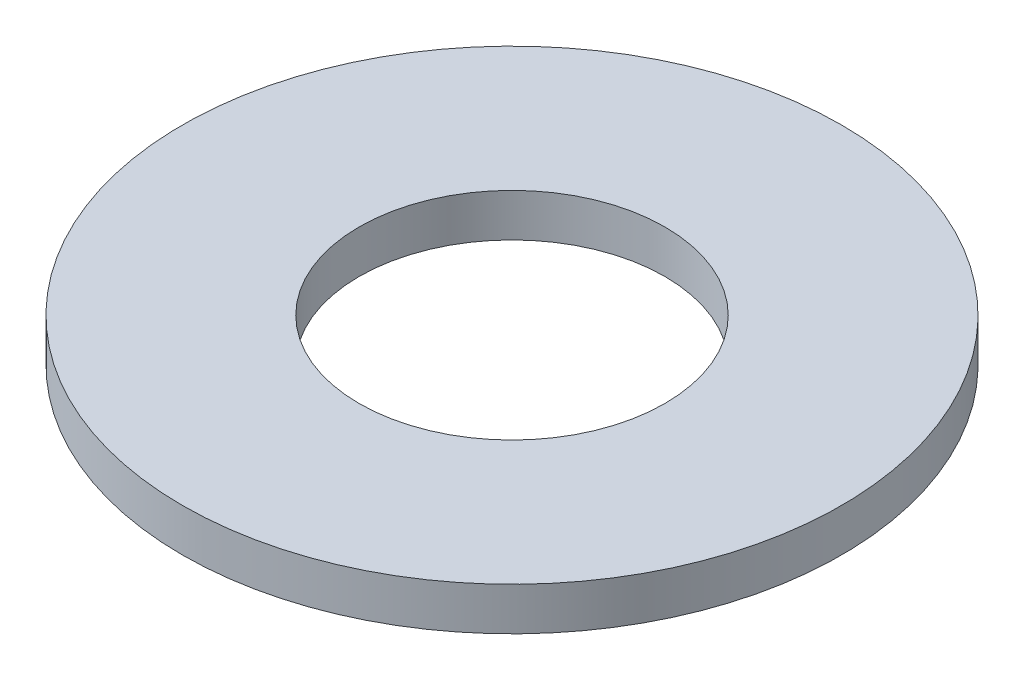
ISO-10303-21;
HEADER;
FILE_DESCRIPTION(('STEP AP214'),'2;1');
FILE_NAME('part.step','',(''),(''),'','','');
FILE_SCHEMA(('AUTOMOTIVE_DESIGN { 1 0 10303 214 1 1 1 1 }'));
ENDSEC;
DATA;
#1=APPLICATION_CONTEXT('core data for automotive mechanical design processes');
#2=APPLICATION_PROTOCOL_DEFINITION('international standard','automotive_design',2000,#1);
#3=PRODUCT_CONTEXT('',#1,'mechanical');
#4=PRODUCT('Part','Part','',(#3));
#5=PRODUCT_RELATED_PRODUCT_CATEGORY('part','',(#4));
#6=PRODUCT_DEFINITION_FORMATION('','',#4);
#7=PRODUCT_DEFINITION_CONTEXT('part definition',#1,'design');
#8=PRODUCT_DEFINITION('design','',#6,#7);
#9=PRODUCT_DEFINITION_SHAPE('','',#8);
#10=(LENGTH_UNIT() NAMED_UNIT(*) SI_UNIT(.MILLI.,.METRE.));
#11=(NAMED_UNIT(*) PLANE_ANGLE_UNIT() SI_UNIT($,.RADIAN.));
#12=(NAMED_UNIT(*) SI_UNIT($,.STERADIAN.) SOLID_ANGLE_UNIT());
#13=UNCERTAINTY_MEASURE_WITH_UNIT(LENGTH_MEASURE(1.E-05),#10,'distance_accuracy_value','');
#14=(GEOMETRIC_REPRESENTATION_CONTEXT(3) GLOBAL_UNCERTAINTY_ASSIGNED_CONTEXT((#13)) GLOBAL_UNIT_ASSIGNED_CONTEXT((#10,
#11,#12)) REPRESENTATION_CONTEXT('',''));
#15=CARTESIAN_POINT('',(0.,0.,0.));
#16=DIRECTION('',(0.,0.,1.));
#17=DIRECTION('',(1.,0.,0.));
#18=AXIS2_PLACEMENT_3D('',#15,#16,#17);
#19=CARTESIAN_POINT('',(0.,1.4478,0.));
#20=DIRECTION('',(0.,-1.,0.));
#21=DIRECTION('',(0.,0.,-1.));
#22=AXIS2_PLACEMENT_3D('',#19,#20,#21);
#23=CYLINDRICAL_SURFACE('',#22,11.1125);
#24=CARTESIAN_POINT('',(0.,1.4478,0.));
#25=DIRECTION('',(0.,1.,0.));
#26=DIRECTION('',(0.,0.,1.));
#27=AXIS2_PLACEMENT_3D('',#24,#25,#26);
#28=CIRCLE('',#27,11.1125);
#29=CARTESIAN_POINT('',(0.,1.4478,11.1125));
#30=VERTEX_POINT('',#29);
#31=EDGE_CURVE('E10',#30,#30,#28,.T.);
#32=ORIENTED_EDGE('',*,*,#31,.F.);
#33=EDGE_LOOP('',(#32));
#34=FACE_BOUND('',#33,.T.);
#35=CARTESIAN_POINT('',(0.,0.,0.));
#36=DIRECTION('',(0.,1.,0.));
#37=DIRECTION('',(0.,0.,1.));
#38=AXIS2_PLACEMENT_3D('',#35,#36,#37);
#39=CIRCLE('',#38,11.1125);
#40=CARTESIAN_POINT('',(0.,0.,11.1125));
#41=VERTEX_POINT('',#40);
#42=EDGE_CURVE('E38',#41,#41,#39,.T.);
#43=ORIENTED_EDGE('',*,*,#42,.T.);
#44=EDGE_LOOP('',(#43));
#45=FACE_BOUND('',#44,.T.);
#46=ADVANCED_FACE('F35',(#34,#45),#23,.T.);
#47=CARTESIAN_POINT('',(0.,1.4478,0.));
#48=DIRECTION('',(0.,1.,0.));
#49=DIRECTION('',(0.,0.,1.));
#50=AXIS2_PLACEMENT_3D('',#47,#48,#49);
#51=PLANE('',#50);
#52=CARTESIAN_POINT('',(0.,1.4478,0.));
#53=DIRECTION('',(0.,1.,0.));
#54=DIRECTION('',(0.,0.,1.));
#55=AXIS2_PLACEMENT_3D('',#52,#53,#54);
#56=CIRCLE('',#55,5.1562);
#57=CARTESIAN_POINT('',(0.,1.4478,5.1562));
#58=VERTEX_POINT('',#57);
#59=EDGE_CURVE('E47',#58,#58,#56,.T.);
#60=ORIENTED_EDGE('',*,*,#59,.F.);
#61=EDGE_LOOP('',(#60));
#62=FACE_BOUND('',#61,.T.);
#63=ORIENTED_EDGE('',*,*,#31,.T.);
#64=EDGE_LOOP('',(#63));
#65=FACE_BOUND('',#64,.T.);
#66=ADVANCED_FACE('F62',(#62,#65),#51,.T.);
#67=CARTESIAN_POINT('',(0.,0.,0.));
#68=DIRECTION('',(0.,1.,0.));
#69=DIRECTION('',(0.,0.,1.));
#70=AXIS2_PLACEMENT_3D('',#67,#68,#69);
#71=PLANE('',#70);
#72=CARTESIAN_POINT('',(0.,0.,0.));
#73=DIRECTION('',(0.,1.,0.));
#74=DIRECTION('',(0.,0.,1.));
#75=AXIS2_PLACEMENT_3D('',#72,#73,#74);
#76=CIRCLE('',#75,5.1562);
#77=CARTESIAN_POINT('',(0.,0.,5.1562));
#78=VERTEX_POINT('',#77);
#79=EDGE_CURVE('E45',#78,#78,#76,.T.);
#80=ORIENTED_EDGE('',*,*,#79,.T.);
#81=EDGE_LOOP('',(#80));
#82=FACE_BOUND('',#81,.T.);
#83=ORIENTED_EDGE('',*,*,#42,.F.);
#84=EDGE_LOOP('',(#83));
#85=FACE_BOUND('',#84,.T.);
#86=ADVANCED_FACE('F53',(#82,#85),#71,.F.);
#87=CARTESIAN_POINT('',(0.,0.,0.));
#88=DIRECTION('',(0.,1.,0.));
#89=DIRECTION('',(0.,0.,1.));
#90=AXIS2_PLACEMENT_3D('',#87,#88,#89);
#91=CYLINDRICAL_SURFACE('',#90,5.1562);
#92=ORIENTED_EDGE('',*,*,#79,.F.);
#93=EDGE_LOOP('',(#92));
#94=FACE_BOUND('',#93,.T.);
#95=ORIENTED_EDGE('',*,*,#59,.T.);
#96=EDGE_LOOP('',(#95));
#97=FACE_BOUND('',#96,.T.);
#98=ADVANCED_FACE('F56',(#94,#97),#91,.F.);
#99=CLOSED_SHELL('',(#46,#66,#86,#98));
#100=MANIFOLD_SOLID_BREP('B2',#99);
#101=ADVANCED_BREP_SHAPE_REPRESENTATION('',(#18,#100),#14);
#102=SHAPE_DEFINITION_REPRESENTATION(#9,#101);
ENDSEC;
END-ISO-10303-21;
